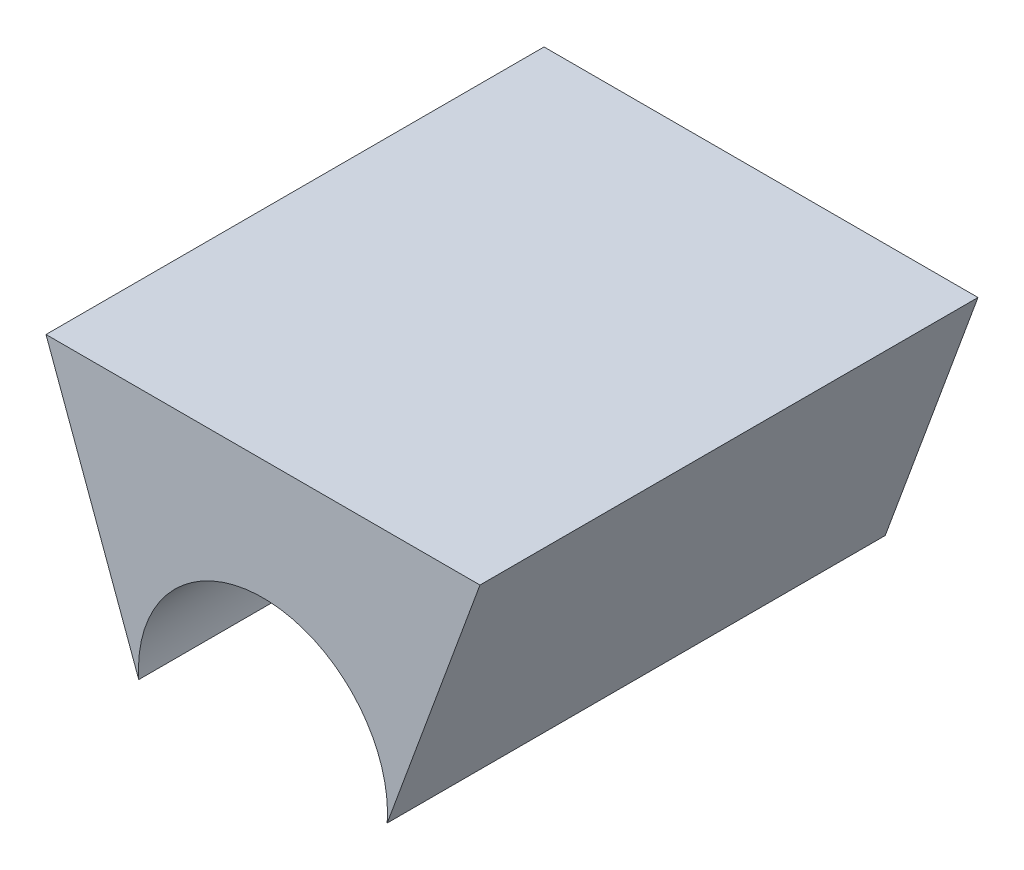
ISO-10303-21;
HEADER;
FILE_DESCRIPTION(('STEP AP214'),'2;1');
FILE_NAME('part.step','',(''),(''),'','','');
FILE_SCHEMA(('AUTOMOTIVE_DESIGN { 1 0 10303 214 1 1 1 1 }'));
ENDSEC;
DATA;
#1=APPLICATION_CONTEXT('core data for automotive mechanical design processes');
#2=APPLICATION_PROTOCOL_DEFINITION('international standard','automotive_design',2000,#1);
#3=PRODUCT_CONTEXT('',#1,'mechanical');
#4=PRODUCT('Part','Part','',(#3));
#5=PRODUCT_RELATED_PRODUCT_CATEGORY('part','',(#4));
#6=PRODUCT_DEFINITION_FORMATION('','',#4);
#7=PRODUCT_DEFINITION_CONTEXT('part definition',#1,'design');
#8=PRODUCT_DEFINITION('design','',#6,#7);
#9=PRODUCT_DEFINITION_SHAPE('','',#8);
#10=(LENGTH_UNIT() NAMED_UNIT(*) SI_UNIT(.MILLI.,.METRE.));
#11=(NAMED_UNIT(*) PLANE_ANGLE_UNIT() SI_UNIT($,.RADIAN.));
#12=(NAMED_UNIT(*) SI_UNIT($,.STERADIAN.) SOLID_ANGLE_UNIT());
#13=UNCERTAINTY_MEASURE_WITH_UNIT(LENGTH_MEASURE(1.E-05),#10,'distance_accuracy_value','');
#14=(GEOMETRIC_REPRESENTATION_CONTEXT(3) GLOBAL_UNCERTAINTY_ASSIGNED_CONTEXT((#13)) GLOBAL_UNIT_ASSIGNED_CONTEXT((#10,
#11,#12)) REPRESENTATION_CONTEXT('',''));
#15=CARTESIAN_POINT('',(0.,0.,0.));
#16=DIRECTION('',(0.,0.,1.));
#17=DIRECTION('',(1.,0.,0.));
#18=AXIS2_PLACEMENT_3D('',#15,#16,#17);
#19=CARTESIAN_POINT('',(-4.35673336002135,4.9,10.));
#20=DIRECTION('',(0.,-1.,0.));
#21=DIRECTION('',(0.,0.,-1.));
#22=AXIS2_PLACEMENT_3D('',#19,#20,#21);
#23=PLANE('',#22);
#24=DIRECTION('',(-1.,0.,0.));
#25=VECTOR('',#24,1.);
#26=CARTESIAN_POINT('',(-4.35673336002135,4.9,0.));
#27=LINE('',#26,#25);
#28=CARTESIAN_POINT('',(4.35673336002135,4.9,0.));
#29=VERTEX_POINT('',#28);
#30=CARTESIAN_POINT('',(-4.35673336002135,4.9,0.));
#31=VERTEX_POINT('',#30);
#32=EDGE_CURVE('E89',#29,#31,#27,.T.);
#33=ORIENTED_EDGE('',*,*,#32,.T.);
#34=DIRECTION('',(0.,0.,-1.));
#35=VECTOR('',#34,1.);
#36=CARTESIAN_POINT('',(-4.35673336002135,4.9,10.));
#37=LINE('',#36,#35);
#38=CARTESIAN_POINT('',(-4.35673336002135,4.9,10.));
#39=VERTEX_POINT('',#38);
#40=EDGE_CURVE('E44',#39,#31,#37,.T.);
#41=ORIENTED_EDGE('',*,*,#40,.F.);
#42=DIRECTION('',(-1.,0.,0.));
#43=VECTOR('',#42,1.);
#44=CARTESIAN_POINT('',(-4.35673336002135,4.9,10.));
#45=LINE('',#44,#43);
#46=CARTESIAN_POINT('',(4.35673336002135,4.9,10.));
#47=VERTEX_POINT('',#46);
#48=EDGE_CURVE('E83',#47,#39,#45,.T.);
#49=ORIENTED_EDGE('',*,*,#48,.F.);
#50=DIRECTION('',(0.,0.,-1.));
#51=VECTOR('',#50,1.);
#52=CARTESIAN_POINT('',(4.35673336002135,4.9,10.));
#53=LINE('',#52,#51);
#54=EDGE_CURVE('E76',#47,#29,#53,.T.);
#55=ORIENTED_EDGE('',*,*,#54,.T.);
#56=EDGE_LOOP('',(#33,#41,#49,#55));
#57=FACE_BOUND('',#56,.T.);
#58=ADVANCED_FACE('F37',(#57),#23,.F.);
#59=CARTESIAN_POINT('',(-4.35673336002135,4.9,10.));
#60=DIRECTION('',(0.938673811977724,0.344806430779951,0.));
#61=DIRECTION('',(-0.344806430779951,0.938673811977724,0.));
#62=AXIS2_PLACEMENT_3D('',#59,#60,#61);
#63=PLANE('',#62);
#64=DIRECTION('',(0.344806430779951,-0.938673811977724,0.));
#65=VECTOR('',#64,1.);
#66=CARTESIAN_POINT('',(-4.35673336002135,4.9,0.));
#67=LINE('',#66,#65);
#68=CARTESIAN_POINT('',(-2.4941816502925,-0.170463765487474,0.));
#69=VERTEX_POINT('',#68);
#70=EDGE_CURVE('E84',#31,#69,#67,.T.);
#71=ORIENTED_EDGE('',*,*,#70,.T.);
#72=DIRECTION('',(0.,0.,1.));
#73=VECTOR('',#72,1.);
#74=CARTESIAN_POINT('',(-2.4941816502925,-0.170463765487476,0.));
#75=LINE('',#74,#73);
#76=CARTESIAN_POINT('',(-2.4941816502925,-0.170463765487474,10.));
#77=VERTEX_POINT('',#76);
#78=EDGE_CURVE('E51',#69,#77,#75,.T.);
#79=ORIENTED_EDGE('',*,*,#78,.T.);
#80=DIRECTION('',(0.344806430779951,-0.938673811977724,0.));
#81=VECTOR('',#80,1.);
#82=CARTESIAN_POINT('',(-4.35673336002135,4.9,10.));
#83=LINE('',#82,#81);
#84=EDGE_CURVE('E102',#39,#77,#83,.T.);
#85=ORIENTED_EDGE('',*,*,#84,.F.);
#86=ORIENTED_EDGE('',*,*,#40,.T.);
#87=EDGE_LOOP('',(#71,#79,#85,#86));
#88=FACE_BOUND('',#87,.T.);
#89=ADVANCED_FACE('F100',(#88),#63,.F.);
#90=CARTESIAN_POINT('',(4.35673336002135,4.9,10.));
#91=DIRECTION('',(-0.938673811977724,0.344806430779951,0.));
#92=DIRECTION('',(-0.344806430779951,-0.938673811977724,0.));
#93=AXIS2_PLACEMENT_3D('',#90,#91,#92);
#94=PLANE('',#93);
#95=DIRECTION('',(0.344806430779951,0.938673811977724,0.));
#96=VECTOR('',#95,1.);
#97=CARTESIAN_POINT('',(4.35673336002135,4.9,10.));
#98=LINE('',#97,#96);
#99=CARTESIAN_POINT('',(2.4941816502925,-0.170463765487476,10.));
#100=VERTEX_POINT('',#99);
#101=EDGE_CURVE('E59',#100,#47,#98,.T.);
#102=ORIENTED_EDGE('',*,*,#101,.F.);
#103=DIRECTION('',(0.,0.,1.));
#104=VECTOR('',#103,1.);
#105=CARTESIAN_POINT('',(2.4941816502925,-0.170463765487475,0.));
#106=LINE('',#105,#104);
#107=CARTESIAN_POINT('',(2.4941816502925,-0.170463765487476,0.));
#108=VERTEX_POINT('',#107);
#109=EDGE_CURVE('E80',#100,#108,#106,.F.);
#110=ORIENTED_EDGE('',*,*,#109,.T.);
#111=DIRECTION('',(0.344806430779951,0.938673811977724,0.));
#112=VECTOR('',#111,1.);
#113=CARTESIAN_POINT('',(4.35673336002135,4.9,0.));
#114=LINE('',#113,#112);
#115=EDGE_CURVE('E73',#108,#29,#114,.T.);
#116=ORIENTED_EDGE('',*,*,#115,.T.);
#117=ORIENTED_EDGE('',*,*,#54,.F.);
#118=EDGE_LOOP('',(#102,#110,#116,#117));
#119=FACE_BOUND('',#118,.T.);
#120=ADVANCED_FACE('F75',(#119),#94,.F.);
#121=CARTESIAN_POINT('',(0.,0.,10.));
#122=DIRECTION('',(0.,0.,1.));
#123=DIRECTION('',(1.,0.,0.));
#124=AXIS2_PLACEMENT_3D('',#121,#122,#123);
#125=PLANE('',#124);
#126=CARTESIAN_POINT('',(0.,0.,10.));
#127=DIRECTION('',(0.,0.,1.));
#128=DIRECTION('',(1.,0.,0.));
#129=AXIS2_PLACEMENT_3D('',#126,#127,#128);
#130=CIRCLE('',#129,2.5);
#131=EDGE_CURVE('E108',#100,#77,#130,.T.);
#132=ORIENTED_EDGE('',*,*,#131,.F.);
#133=ORIENTED_EDGE('',*,*,#101,.T.);
#134=ORIENTED_EDGE('',*,*,#48,.T.);
#135=ORIENTED_EDGE('',*,*,#84,.T.);
#136=EDGE_LOOP('',(#132,#133,#134,#135));
#137=FACE_BOUND('',#136,.T.);
#138=ADVANCED_FACE('F104',(#137),#125,.T.);
#139=CARTESIAN_POINT('',(0.,0.,0.));
#140=DIRECTION('',(0.,0.,1.));
#141=DIRECTION('',(1.,0.,0.));
#142=AXIS2_PLACEMENT_3D('',#139,#140,#141);
#143=PLANE('',#142);
#144=ORIENTED_EDGE('',*,*,#115,.F.);
#145=CARTESIAN_POINT('',(0.,0.,0.));
#146=DIRECTION('',(0.,0.,1.));
#147=DIRECTION('',(1.,0.,0.));
#148=AXIS2_PLACEMENT_3D('',#145,#146,#147);
#149=CIRCLE('',#148,2.5);
#150=EDGE_CURVE('E11',#108,#69,#149,.T.);
#151=ORIENTED_EDGE('',*,*,#150,.T.);
#152=ORIENTED_EDGE('',*,*,#70,.F.);
#153=ORIENTED_EDGE('',*,*,#32,.F.);
#154=EDGE_LOOP('',(#144,#151,#152,#153));
#155=FACE_BOUND('',#154,.T.);
#156=ADVANCED_FACE('F91',(#155),#143,.F.);
#157=CARTESIAN_POINT('',(0.,0.,0.));
#158=DIRECTION('',(0.,0.,1.));
#159=DIRECTION('',(1.,0.,0.));
#160=AXIS2_PLACEMENT_3D('',#157,#158,#159);
#161=CYLINDRICAL_SURFACE('',#160,2.5);
#162=ORIENTED_EDGE('',*,*,#150,.F.);
#163=ORIENTED_EDGE('',*,*,#109,.F.);
#164=ORIENTED_EDGE('',*,*,#131,.T.);
#165=ORIENTED_EDGE('',*,*,#78,.F.);
#166=EDGE_LOOP('',(#162,#163,#164,#165));
#167=FACE_BOUND('',#166,.T.);
#168=ADVANCED_FACE('F109',(#167),#161,.F.);
#169=CLOSED_SHELL('',(#58,#89,#120,#138,#156,#168));
#170=MANIFOLD_SOLID_BREP('B2',#169);
#171=ADVANCED_BREP_SHAPE_REPRESENTATION('',(#18,#170),#14);
#172=SHAPE_DEFINITION_REPRESENTATION(#9,#171);
ENDSEC;
END-ISO-10303-21;
